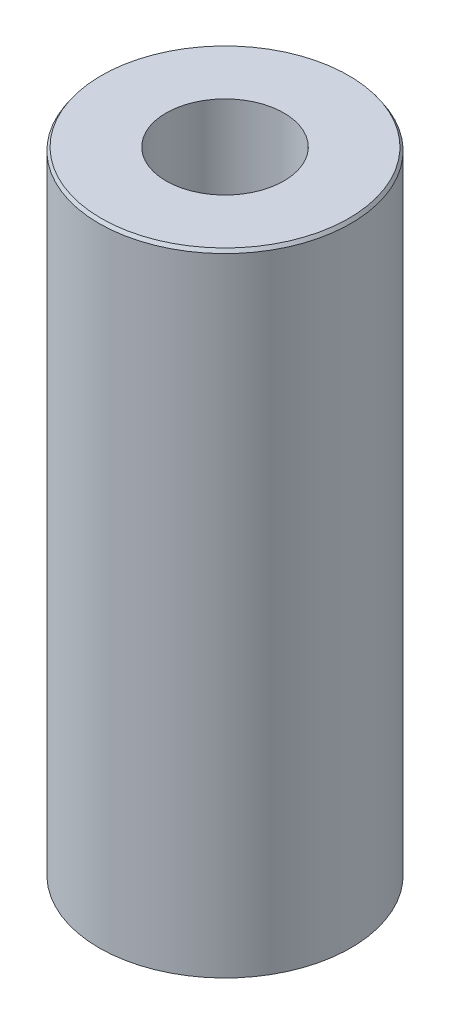
ISO-10303-21;
HEADER;
FILE_DESCRIPTION(('STEP AP214'),'2;1');
FILE_NAME('part.step','',(''),(''),'','','');
FILE_SCHEMA(('AUTOMOTIVE_DESIGN { 1 0 10303 214 1 1 1 1 }'));
ENDSEC;
DATA;
#1=APPLICATION_CONTEXT('core data for automotive mechanical design processes');
#2=APPLICATION_PROTOCOL_DEFINITION('international standard','automotive_design',2000,#1);
#3=PRODUCT_CONTEXT('',#1,'mechanical');
#4=PRODUCT('Part','Part','',(#3));
#5=PRODUCT_RELATED_PRODUCT_CATEGORY('part','',(#4));
#6=PRODUCT_DEFINITION_FORMATION('','',#4);
#7=PRODUCT_DEFINITION_CONTEXT('part definition',#1,'design');
#8=PRODUCT_DEFINITION('design','',#6,#7);
#9=PRODUCT_DEFINITION_SHAPE('','',#8);
#10=(LENGTH_UNIT() NAMED_UNIT(*) SI_UNIT(.MILLI.,.METRE.));
#11=(NAMED_UNIT(*) PLANE_ANGLE_UNIT() SI_UNIT($,.RADIAN.));
#12=(NAMED_UNIT(*) SI_UNIT($,.STERADIAN.) SOLID_ANGLE_UNIT());
#13=UNCERTAINTY_MEASURE_WITH_UNIT(LENGTH_MEASURE(1.E-05),#10,'distance_accuracy_value','');
#14=(GEOMETRIC_REPRESENTATION_CONTEXT(3) GLOBAL_UNCERTAINTY_ASSIGNED_CONTEXT((#13)) GLOBAL_UNIT_ASSIGNED_CONTEXT((#10,
#11,#12)) REPRESENTATION_CONTEXT('',''));
#15=CARTESIAN_POINT('',(0.,0.,0.));
#16=DIRECTION('',(0.,0.,1.));
#17=DIRECTION('',(1.,0.,0.));
#18=AXIS2_PLACEMENT_3D('',#15,#16,#17);
#19=CARTESIAN_POINT('',(0.,238.673050811395,0.));
#20=DIRECTION('',(0.,-1.,0.));
#21=DIRECTION('',(0.,0.,-1.));
#22=AXIS2_PLACEMENT_3D('',#19,#20,#21);
#23=CYLINDRICAL_SURFACE('',#22,47.5);
#24=CARTESIAN_POINT('',(0.,237.430188134593,0.));
#25=DIRECTION('',(0.,1.,0.));
#26=DIRECTION('',(0.,0.,1.));
#27=AXIS2_PLACEMENT_3D('',#24,#25,#26);
#28=CIRCLE('',#27,47.5);
#29=CARTESIAN_POINT('',(0.,237.430188134593,47.5));
#30=VERTEX_POINT('',#29);
#31=EDGE_CURVE('E50',#30,#30,#28,.F.);
#32=ORIENTED_EDGE('',*,*,#31,.T.);
#33=EDGE_LOOP('',(#32));
#34=FACE_BOUND('',#33,.T.);
#35=CARTESIAN_POINT('',(0.,0.832250776508114,0.));
#36=DIRECTION('',(0.,1.,0.));
#37=DIRECTION('',(0.,0.,1.));
#38=AXIS2_PLACEMENT_3D('',#35,#36,#37);
#39=CIRCLE('',#38,47.5);
#40=CARTESIAN_POINT('',(0.,0.832250776508114,47.5));
#41=VERTEX_POINT('',#40);
#42=EDGE_CURVE('E51',#41,#41,#39,.T.);
#43=ORIENTED_EDGE('',*,*,#42,.T.);
#44=EDGE_LOOP('',(#43));
#45=FACE_BOUND('',#44,.T.);
#46=ADVANCED_FACE('F39',(#34,#45),#23,.T.);
#47=CARTESIAN_POINT('',(0.,238.673050811395,0.));
#48=DIRECTION('',(0.,1.,0.));
#49=DIRECTION('',(0.,0.,1.));
#50=AXIS2_PLACEMENT_3D('',#47,#48,#49);
#51=PLANE('',#50);
#52=CARTESIAN_POINT('',(0.,238.673050811395,0.));
#53=DIRECTION('',(0.,1.,0.));
#54=DIRECTION('',(0.,0.,1.));
#55=AXIS2_PLACEMENT_3D('',#52,#53,#54);
#56=CIRCLE('',#55,46.6677492234919);
#57=CARTESIAN_POINT('',(0.,238.673050811395,46.6677492234919));
#58=VERTEX_POINT('',#57);
#59=EDGE_CURVE('E54',#58,#58,#56,.T.);
#60=ORIENTED_EDGE('',*,*,#59,.T.);
#61=EDGE_LOOP('',(#60));
#62=FACE_BOUND('',#61,.T.);
#63=CARTESIAN_POINT('',(0.,238.673050811395,0.));
#64=DIRECTION('',(0.,1.,0.));
#65=DIRECTION('',(0.,0.,1.));
#66=AXIS2_PLACEMENT_3D('',#63,#64,#65);
#67=CIRCLE('',#66,22.2229243839153);
#68=CARTESIAN_POINT('',(0.,238.673050811395,22.2229243839153));
#69=VERTEX_POINT('',#68);
#70=EDGE_CURVE('E58',#69,#69,#67,.T.);
#71=ORIENTED_EDGE('',*,*,#70,.F.);
#72=EDGE_LOOP('',(#71));
#73=FACE_BOUND('',#72,.T.);
#74=ADVANCED_FACE('F69',(#62,#73),#51,.T.);
#75=CARTESIAN_POINT('',(0.,0.,0.));
#76=DIRECTION('',(0.,1.,0.));
#77=DIRECTION('',(0.,0.,1.));
#78=AXIS2_PLACEMENT_3D('',#75,#76,#77);
#79=PLANE('',#78);
#80=CARTESIAN_POINT('',(0.,0.,0.));
#81=DIRECTION('',(0.,1.,0.));
#82=DIRECTION('',(0.,0.,1.));
#83=AXIS2_PLACEMENT_3D('',#80,#81,#82);
#84=CIRCLE('',#83,46.2571373231974);
#85=CARTESIAN_POINT('',(0.,0.,46.2571373231974));
#86=VERTEX_POINT('',#85);
#87=EDGE_CURVE('E10',#86,#86,#84,.F.);
#88=ORIENTED_EDGE('',*,*,#87,.T.);
#89=EDGE_LOOP('',(#88));
#90=FACE_BOUND('',#89,.T.);
#91=CARTESIAN_POINT('',(0.,0.,0.));
#92=DIRECTION('',(0.,1.,0.));
#93=DIRECTION('',(0.,0.,1.));
#94=AXIS2_PLACEMENT_3D('',#91,#92,#93);
#95=CIRCLE('',#94,22.2229243839153);
#96=CARTESIAN_POINT('',(0.,0.,22.2229243839153));
#97=VERTEX_POINT('',#96);
#98=EDGE_CURVE('E63',#97,#97,#95,.T.);
#99=ORIENTED_EDGE('',*,*,#98,.T.);
#100=EDGE_LOOP('',(#99));
#101=FACE_BOUND('',#100,.T.);
#102=ADVANCED_FACE('F75',(#90,#101),#79,.F.);
#103=CARTESIAN_POINT('',(0.,238.673050811395,0.));
#104=DIRECTION('',(0.,-1.,0.));
#105=DIRECTION('',(0.,0.,-1.));
#106=AXIS2_PLACEMENT_3D('',#103,#104,#105);
#107=CYLINDRICAL_SURFACE('',#106,22.2229243839153);
#108=ORIENTED_EDGE('',*,*,#70,.T.);
#109=EDGE_LOOP('',(#108));
#110=FACE_BOUND('',#109,.T.);
#111=ORIENTED_EDGE('',*,*,#98,.F.);
#112=EDGE_LOOP('',(#111));
#113=FACE_BOUND('',#112,.T.);
#114=ADVANCED_FACE('F70',(#110,#113),#107,.F.);
#115=CARTESIAN_POINT('',(0.,238.673050811395,0.));
#116=DIRECTION('',(0.,-1.,0.));
#117=DIRECTION('',(0.,0.,-1.));
#118=AXIS2_PLACEMENT_3D('',#115,#116,#117);
#119=CONICAL_SURFACE('',#118,46.6677492234919,0.590047249827266);
#120=ORIENTED_EDGE('',*,*,#31,.F.);
#121=EDGE_LOOP('',(#120));
#122=FACE_BOUND('',#121,.T.);
#123=ORIENTED_EDGE('',*,*,#59,.F.);
#124=EDGE_LOOP('',(#123));
#125=FACE_BOUND('',#124,.T.);
#126=ADVANCED_FACE('F81',(#122,#125),#119,.T.);
#127=CARTESIAN_POINT('',(0.,0.832250776508114,0.));
#128=DIRECTION('',(0.,1.,0.));
#129=DIRECTION('',(0.,0.,1.));
#130=AXIS2_PLACEMENT_3D('',#127,#128,#129);
#131=CONICAL_SURFACE('',#130,47.5,0.980749076967629);
#132=ORIENTED_EDGE('',*,*,#87,.F.);
#133=EDGE_LOOP('',(#132));
#134=FACE_BOUND('',#133,.T.);
#135=ORIENTED_EDGE('',*,*,#42,.F.);
#136=EDGE_LOOP('',(#135));
#137=FACE_BOUND('',#136,.T.);
#138=ADVANCED_FACE('F45',(#134,#137),#131,.T.);
#139=CLOSED_SHELL('',(#46,#74,#102,#114,#126,#138));
#140=MANIFOLD_SOLID_BREP('B2',#139);
#141=ADVANCED_BREP_SHAPE_REPRESENTATION('',(#18,#140),#14);
#142=SHAPE_DEFINITION_REPRESENTATION(#9,#141);
ENDSEC;
END-ISO-10303-21;
